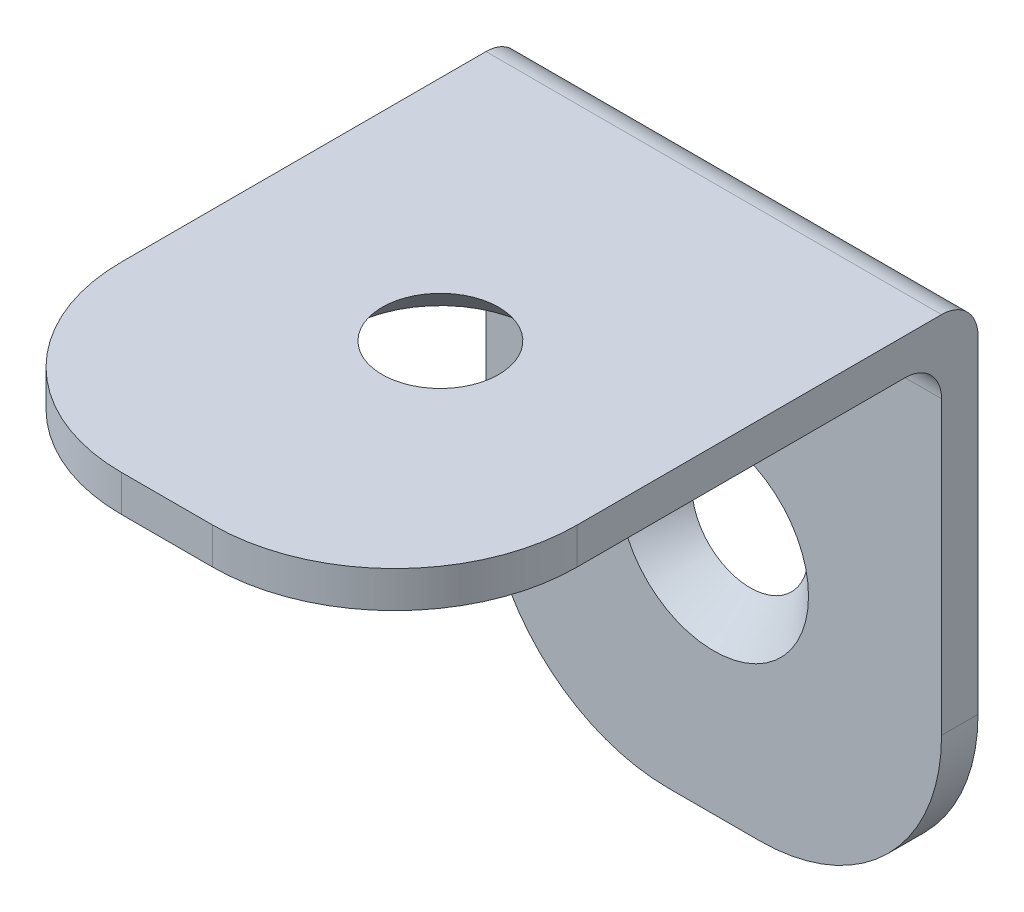
ISO-10303-21;
HEADER;
FILE_DESCRIPTION(('STEP AP214'),'2;1');
FILE_NAME('part.step','',(''),(''),'','','');
FILE_SCHEMA(('AUTOMOTIVE_DESIGN { 1 0 10303 214 1 1 1 1 }'));
ENDSEC;
DATA;
#1=APPLICATION_CONTEXT('core data for automotive mechanical design processes');
#2=APPLICATION_PROTOCOL_DEFINITION('international standard','automotive_design',2000,#1);
#3=PRODUCT_CONTEXT('',#1,'mechanical');
#4=PRODUCT('Part','Part','',(#3));
#5=PRODUCT_RELATED_PRODUCT_CATEGORY('part','',(#4));
#6=PRODUCT_DEFINITION_FORMATION('','',#4);
#7=PRODUCT_DEFINITION_CONTEXT('part definition',#1,'design');
#8=PRODUCT_DEFINITION('design','',#6,#7);
#9=PRODUCT_DEFINITION_SHAPE('','',#8);
#10=(LENGTH_UNIT() NAMED_UNIT(*) SI_UNIT(.MILLI.,.METRE.));
#11=(NAMED_UNIT(*) PLANE_ANGLE_UNIT() SI_UNIT($,.RADIAN.));
#12=(NAMED_UNIT(*) SI_UNIT($,.STERADIAN.) SOLID_ANGLE_UNIT());
#13=UNCERTAINTY_MEASURE_WITH_UNIT(LENGTH_MEASURE(1.E-05),#10,'distance_accuracy_value','');
#14=(GEOMETRIC_REPRESENTATION_CONTEXT(3) GLOBAL_UNCERTAINTY_ASSIGNED_CONTEXT((#13)) GLOBAL_UNIT_ASSIGNED_CONTEXT((#10,
#11,#12)) REPRESENTATION_CONTEXT('',''));
#15=CARTESIAN_POINT('',(0.,0.,0.));
#16=DIRECTION('',(0.,0.,1.));
#17=DIRECTION('',(1.,0.,0.));
#18=AXIS2_PLACEMENT_3D('',#15,#16,#17);
#19=CARTESIAN_POINT('',(-2.50000000000065,2.00000000000003,5.));
#20=DIRECTION('',(0.,-1.,0.));
#21=DIRECTION('',(0.,0.,-1.00000000000001));
#22=AXIS2_PLACEMENT_3D('',#19,#20,#21);
#23=PLANE('',#22);
#24=CARTESIAN_POINT('',(0.,1.99999999999994,0.));
#25=DIRECTION('',(0.,-1.,0.));
#26=DIRECTION('',(0.,0.,-1.00000000000001));
#27=AXIS2_PLACEMENT_3D('',#24,#25,#26);
#28=CIRCLE('',#27,3.2);
#29=CARTESIAN_POINT('',(0.,1.99999999999994,-3.20000000000004));
#30=VERTEX_POINT('',#29);
#31=EDGE_CURVE('E373',#30,#30,#28,.T.);
#32=ORIENTED_EDGE('',*,*,#31,.T.);
#33=EDGE_LOOP('',(#32));
#34=FACE_BOUND('',#33,.T.);
#35=DIRECTION('',(0.,0.,-1.00000000000001));
#36=VECTOR('',#35,1.);
#37=CARTESIAN_POINT('',(12.4999999999992,1.99999999999998,5.00000000000125));
#38=LINE('',#37,#36);
#39=CARTESIAN_POINT('',(12.4999999999992,1.99999999999998,5.00000000000125));
#40=VERTEX_POINT('',#39);
#41=CARTESIAN_POINT('',(12.4999999999997,1.9999999999998,-14.9999999999996));
#42=VERTEX_POINT('',#41);
#43=EDGE_CURVE('E170',#40,#42,#38,.T.);
#44=ORIENTED_EDGE('',*,*,#43,.T.);
#45=DIRECTION('',(1.00000000000001,0.,0.));
#46=VECTOR('',#45,1.);
#47=CARTESIAN_POINT('',(-2.5000000000002,1.99999999999978,-15.000000000001));
#48=LINE('',#47,#46);
#49=CARTESIAN_POINT('',(-12.5000000000003,1.9999999999998,-14.9999999999992));
#50=VERTEX_POINT('',#49);
#51=EDGE_CURVE('E42',#42,#50,#48,.F.);
#52=ORIENTED_EDGE('',*,*,#51,.T.);
#53=DIRECTION('',(0.,0.,1.00000000000001));
#54=VECTOR('',#53,1.);
#55=CARTESIAN_POINT('',(-12.5000000000007,1.99999999999998,5.00000000000164));
#56=LINE('',#55,#54);
#57=CARTESIAN_POINT('',(-12.5000000000007,1.99999999999998,5.00000000000164));
#58=VERTEX_POINT('',#57);
#59=EDGE_CURVE('E172',#50,#58,#56,.T.);
#60=ORIENTED_EDGE('',*,*,#59,.T.);
#61=CARTESIAN_POINT('',(-2.50000000000065,2.00000000000003,5.));
#62=DIRECTION('',(0.,1.,0.));
#63=DIRECTION('',(0.,0.,-1.00000000000001));
#64=AXIS2_PLACEMENT_3D('',#61,#62,#63);
#65=CIRCLE('',#64,10.);
#66=CARTESIAN_POINT('',(-2.50000000000059,2.00000000000004,15.));
#67=VERTEX_POINT('',#66);
#68=EDGE_CURVE('E175',#58,#67,#65,.T.);
#69=ORIENTED_EDGE('',*,*,#68,.T.);
#70=DIRECTION('',(1.00000000000001,0.,0.));
#71=VECTOR('',#70,1.);
#72=CARTESIAN_POINT('',(-2.50000000000059,2.00000000000004,15.));
#73=LINE('',#72,#71);
#74=CARTESIAN_POINT('',(2.49999999999928,2.00000000000006,15.));
#75=VERTEX_POINT('',#74);
#76=EDGE_CURVE('E177',#67,#75,#73,.T.);
#77=ORIENTED_EDGE('',*,*,#76,.T.);
#78=CARTESIAN_POINT('',(2.49999999999935,2.00000000000005,5.));
#79=DIRECTION('',(0.,1.,0.));
#80=DIRECTION('',(0.,0.,1.00000000000001));
#81=AXIS2_PLACEMENT_3D('',#78,#79,#80);
#82=CIRCLE('',#81,10.);
#83=EDGE_CURVE('E179',#75,#40,#82,.T.);
#84=ORIENTED_EDGE('',*,*,#83,.T.);
#85=EDGE_LOOP('',(#44,#52,#60,#69,#77,#84));
#86=FACE_BOUND('',#85,.T.);
#87=ADVANCED_FACE('F34',(#34,#86),#23,.F.);
#88=CARTESIAN_POINT('',(2.49999999999981,-18.,-17.0000000000009));
#89=DIRECTION('',(0.,0.,1.00000000000001));
#90=DIRECTION('',(1.00000000000001,0.,0.));
#91=AXIS2_PLACEMENT_3D('',#88,#89,#90);
#92=PLANE('',#91);
#93=CARTESIAN_POINT('',(-1.94289029309402E-13,-15.0342478014988,-17.0000000000009));
#94=DIRECTION('',(0.,0.,1.00000000000001));
#95=DIRECTION('',(1.00000000000001,0.,0.));
#96=AXIS2_PLACEMENT_3D('',#93,#94,#95);
#97=CIRCLE('',#96,3.19999999999999);
#98=CARTESIAN_POINT('',(3.19999999999985,-15.0342478014988,-17.0000000000009));
#99=VERTEX_POINT('',#98);
#100=EDGE_CURVE('E156',#99,#99,#97,.T.);
#101=ORIENTED_EDGE('',*,*,#100,.T.);
#102=EDGE_LOOP('',(#101));
#103=FACE_BOUND('',#102,.T.);
#104=DIRECTION('',(0.,1.,0.));
#105=VECTOR('',#104,1.);
#106=CARTESIAN_POINT('',(-12.5000000000002,-18.0000000000001,-16.9999999999992));
#107=LINE('',#106,#105);
#108=CARTESIAN_POINT('',(-12.5000000000002,-18.0000000000001,-16.9999999999992));
#109=VERTEX_POINT('',#108);
#110=CARTESIAN_POINT('',(-12.5000000000002,-1.67400815431762E-13,-16.9999999999992));
#111=VERTEX_POINT('',#110);
#112=EDGE_CURVE('E130',#109,#111,#107,.T.);
#113=ORIENTED_EDGE('',*,*,#112,.T.);
#114=DIRECTION('',(1.00000000000001,0.,0.));
#115=VECTOR('',#114,1.);
#116=CARTESIAN_POINT('',(2.49999999999981,-1.10154940724527E-13,-17.0000000000009));
#117=LINE('',#116,#115);
#118=CARTESIAN_POINT('',(12.4999999999996,-1.10154940724527E-13,-16.9999999999996));
#119=VERTEX_POINT('',#118);
#120=EDGE_CURVE('E129',#111,#119,#117,.T.);
#121=ORIENTED_EDGE('',*,*,#120,.T.);
#122=DIRECTION('',(0.,-1.,0.));
#123=VECTOR('',#122,1.);
#124=CARTESIAN_POINT('',(12.4999999999996,-18.,-16.9999999999996));
#125=LINE('',#124,#123);
#126=CARTESIAN_POINT('',(12.4999999999996,-18.,-16.9999999999996));
#127=VERTEX_POINT('',#126);
#128=EDGE_CURVE('E121',#119,#127,#125,.T.);
#129=ORIENTED_EDGE('',*,*,#128,.T.);
#130=CARTESIAN_POINT('',(2.49999999999981,-18.,-17.0000000000009));
#131=DIRECTION('',(0.,0.,-1.00000000000001));
#132=DIRECTION('',(1.00000000000001,0.,0.));
#133=AXIS2_PLACEMENT_3D('',#130,#131,#132);
#134=CIRCLE('',#133,10.);
#135=CARTESIAN_POINT('',(2.49999999999981,-28.0000000000002,-17.000000000001));
#136=VERTEX_POINT('',#135);
#137=EDGE_CURVE('E126',#127,#136,#134,.T.);
#138=ORIENTED_EDGE('',*,*,#137,.T.);
#139=DIRECTION('',(-1.00000000000001,0.,0.));
#140=VECTOR('',#139,1.);
#141=CARTESIAN_POINT('',(2.49999999999981,-28.0000000000002,-17.000000000001));
#142=LINE('',#141,#140);
#143=CARTESIAN_POINT('',(-2.5000000000002,-28.0000000000002,-17.0000000000009));
#144=VERTEX_POINT('',#143);
#145=EDGE_CURVE('E145',#136,#144,#142,.T.);
#146=ORIENTED_EDGE('',*,*,#145,.T.);
#147=CARTESIAN_POINT('',(-2.5000000000002,-18.,-17.0000000000009));
#148=DIRECTION('',(0.,0.,-1.00000000000001));
#149=DIRECTION('',(-1.00000000000001,0.,0.));
#150=AXIS2_PLACEMENT_3D('',#147,#148,#149);
#151=CIRCLE('',#150,10.);
#152=EDGE_CURVE('E147',#144,#109,#151,.T.);
#153=ORIENTED_EDGE('',*,*,#152,.T.);
#154=EDGE_LOOP('',(#113,#121,#129,#138,#146,#153));
#155=FACE_BOUND('',#154,.T.);
#156=ADVANCED_FACE('F124',(#103,#155),#92,.F.);
#157=CARTESIAN_POINT('',(12.4999999999992,1.99999999999998,5.00000000000125));
#158=DIRECTION('',(-1.00000000000001,0.,0.));
#159=DIRECTION('',(0.,0.,1.00000000000001));
#160=AXIS2_PLACEMENT_3D('',#157,#158,#159);
#161=PLANE('',#160);
#162=ORIENTED_EDGE('',*,*,#128,.F.);
#163=CARTESIAN_POINT('',(12.4999999999997,-1.37910516340156E-13,-14.9999999999996));
#164=DIRECTION('',(-1.00000000000001,0.,0.));
#165=DIRECTION('',(0.,0.,1.00000000000001));
#166=AXIS2_PLACEMENT_3D('',#163,#164,#165);
#167=CIRCLE('',#166,2.);
#168=EDGE_CURVE('E56',#119,#42,#167,.F.);
#169=ORIENTED_EDGE('',*,*,#168,.T.);
#170=ORIENTED_EDGE('',*,*,#43,.F.);
#171=DIRECTION('',(0.,-1.,0.));
#172=VECTOR('',#171,1.);
#173=CARTESIAN_POINT('',(12.4999999999992,1.99999999999998,5.00000000000125));
#174=LINE('',#173,#172);
#175=CARTESIAN_POINT('',(12.4999999999992,0.,5.00000000000125));
#176=VERTEX_POINT('',#175);
#177=EDGE_CURVE('E181',#40,#176,#174,.T.);
#178=ORIENTED_EDGE('',*,*,#177,.T.);
#179=DIRECTION('',(0.,0.,-1.00000000000001));
#180=VECTOR('',#179,1.);
#181=CARTESIAN_POINT('',(12.4999999999992,0.,5.00000000000125));
#182=LINE('',#181,#180);
#183=CARTESIAN_POINT('',(12.4999999999995,-1.37910516340156E-13,-12.9999999999996));
#184=VERTEX_POINT('',#183);
#185=EDGE_CURVE('E139',#176,#184,#182,.T.);
#186=ORIENTED_EDGE('',*,*,#185,.T.);
#187=CARTESIAN_POINT('',(12.4999999999995,-2.00000000000013,-12.9999999999996));
#188=DIRECTION('',(-1.00000000000001,0.,0.));
#189=DIRECTION('',(0.,0.,1.00000000000001));
#190=AXIS2_PLACEMENT_3D('',#187,#188,#189);
#191=CIRCLE('',#190,2.);
#192=CARTESIAN_POINT('',(12.4999999999997,-2.00000000000016,-14.9999999999996));
#193=VERTEX_POINT('',#192);
#194=EDGE_CURVE('E209',#184,#193,#191,.T.);
#195=ORIENTED_EDGE('',*,*,#194,.T.);
#196=DIRECTION('',(0.,-1.,0.));
#197=VECTOR('',#196,1.);
#198=CARTESIAN_POINT('',(12.4999999999997,-18.,-14.9999999999996));
#199=LINE('',#198,#197);
#200=CARTESIAN_POINT('',(12.4999999999997,-18.,-14.9999999999996));
#201=VERTEX_POINT('',#200);
#202=EDGE_CURVE('E136',#193,#201,#199,.T.);
#203=ORIENTED_EDGE('',*,*,#202,.T.);
#204=DIRECTION('',(0.,0.,1.00000000000001));
#205=VECTOR('',#204,1.);
#206=CARTESIAN_POINT('',(12.4999999999996,-18.,-16.9999999999996));
#207=LINE('',#206,#205);
#208=EDGE_CURVE('E133',#127,#201,#207,.T.);
#209=ORIENTED_EDGE('',*,*,#208,.F.);
#210=EDGE_LOOP('',(#162,#169,#170,#178,#186,#195,#203,#209));
#211=FACE_BOUND('',#210,.T.);
#212=ADVANCED_FACE('F134',(#211),#161,.F.);
#213=CARTESIAN_POINT('',(-12.5000000000007,1.99999999999998,5.00000000000164));
#214=DIRECTION('',(1.00000000000001,0.,0.));
#215=DIRECTION('',(0.,0.,-1.00000000000001));
#216=AXIS2_PLACEMENT_3D('',#213,#214,#215);
#217=PLANE('',#216);
#218=ORIENTED_EDGE('',*,*,#59,.F.);
#219=CARTESIAN_POINT('',(-12.5000000000003,-2.09901540593194E-13,-14.9999999999992));
#220=DIRECTION('',(1.00000000000001,0.,0.));
#221=DIRECTION('',(0.,0.,-1.00000000000001));
#222=AXIS2_PLACEMENT_3D('',#219,#220,#221);
#223=CIRCLE('',#222,2.);
#224=EDGE_CURVE('E11',#50,#111,#223,.F.);
#225=ORIENTED_EDGE('',*,*,#224,.T.);
#226=ORIENTED_EDGE('',*,*,#112,.F.);
#227=DIRECTION('',(0.,0.,1.00000000000001));
#228=VECTOR('',#227,1.);
#229=CARTESIAN_POINT('',(-12.5000000000002,-18.0000000000001,-16.9999999999992));
#230=LINE('',#229,#228);
#231=CARTESIAN_POINT('',(-12.5000000000003,-18.,-14.9999999999992));
#232=VERTEX_POINT('',#231);
#233=EDGE_CURVE('E152',#109,#232,#230,.T.);
#234=ORIENTED_EDGE('',*,*,#233,.T.);
#235=DIRECTION('',(0.,1.,0.));
#236=VECTOR('',#235,1.);
#237=CARTESIAN_POINT('',(-12.5000000000003,-18.,-14.9999999999992));
#238=LINE('',#237,#236);
#239=CARTESIAN_POINT('',(-12.5000000000003,-2.00000000000017,-14.9999999999992));
#240=VERTEX_POINT('',#239);
#241=EDGE_CURVE('E153',#232,#240,#238,.T.);
#242=ORIENTED_EDGE('',*,*,#241,.T.);
#243=CARTESIAN_POINT('',(-12.5000000000004,-2.00000000000014,-12.9999999999992));
#244=DIRECTION('',(1.00000000000001,0.,0.));
#245=DIRECTION('',(0.,0.,-1.00000000000001));
#246=AXIS2_PLACEMENT_3D('',#243,#244,#245);
#247=CIRCLE('',#246,2.);
#248=CARTESIAN_POINT('',(-12.5000000000004,-2.09901540593194E-13,-12.9999999999992));
#249=VERTEX_POINT('',#248);
#250=EDGE_CURVE('E207',#240,#249,#247,.T.);
#251=ORIENTED_EDGE('',*,*,#250,.T.);
#252=DIRECTION('',(0.,0.,1.00000000000001));
#253=VECTOR('',#252,1.);
#254=CARTESIAN_POINT('',(-12.5000000000007,0.,5.00000000000164));
#255=LINE('',#254,#253);
#256=CARTESIAN_POINT('',(-12.5000000000007,0.,5.00000000000164));
#257=VERTEX_POINT('',#256);
#258=EDGE_CURVE('E184',#249,#257,#255,.T.);
#259=ORIENTED_EDGE('',*,*,#258,.T.);
#260=DIRECTION('',(0.,-1.,0.));
#261=VECTOR('',#260,1.);
#262=CARTESIAN_POINT('',(-12.5000000000007,1.99999999999998,5.00000000000164));
#263=LINE('',#262,#261);
#264=EDGE_CURVE('E199',#58,#257,#263,.T.);
#265=ORIENTED_EDGE('',*,*,#264,.F.);
#266=EDGE_LOOP('',(#218,#225,#226,#234,#242,#251,#259,#265));
#267=FACE_BOUND('',#266,.T.);
#268=ADVANCED_FACE('F224',(#267),#217,.F.);
#269=CARTESIAN_POINT('',(-2.50000000000065,2.00000000000003,5.));
#270=DIRECTION('',(0.,-1.,0.));
#271=DIRECTION('',(0.,0.,-1.00000000000001));
#272=AXIS2_PLACEMENT_3D('',#269,#270,#271);
#273=CYLINDRICAL_SURFACE('',#272,10.);
#274=CARTESIAN_POINT('',(-2.50000000000065,1.04950770296597E-13,5.));
#275=DIRECTION('',(0.,1.,0.));
#276=DIRECTION('',(0.,0.,-1.00000000000001));
#277=AXIS2_PLACEMENT_3D('',#274,#275,#276);
#278=CIRCLE('',#277,10.);
#279=CARTESIAN_POINT('',(-2.50000000000059,0.,15.));
#280=VERTEX_POINT('',#279);
#281=EDGE_CURVE('E186',#257,#280,#278,.T.);
#282=ORIENTED_EDGE('',*,*,#281,.T.);
#283=DIRECTION('',(0.,-1.,0.));
#284=VECTOR('',#283,1.);
#285=CARTESIAN_POINT('',(-2.50000000000059,2.00000000000004,15.));
#286=LINE('',#285,#284);
#287=EDGE_CURVE('E196',#67,#280,#286,.T.);
#288=ORIENTED_EDGE('',*,*,#287,.F.);
#289=ORIENTED_EDGE('',*,*,#68,.F.);
#290=ORIENTED_EDGE('',*,*,#264,.T.);
#291=EDGE_LOOP('',(#282,#288,#289,#290));
#292=FACE_BOUND('',#291,.T.);
#293=ADVANCED_FACE('F233',(#292),#273,.T.);
#294=CARTESIAN_POINT('',(-2.50000000000059,2.00000000000004,15.));
#295=DIRECTION('',(0.,0.,-1.00000000000001));
#296=DIRECTION('',(-1.00000000000001,0.,0.));
#297=AXIS2_PLACEMENT_3D('',#294,#295,#296);
#298=PLANE('',#297);
#299=DIRECTION('',(1.00000000000001,0.,0.));
#300=VECTOR('',#299,1.);
#301=CARTESIAN_POINT('',(-2.50000000000059,0.,15.));
#302=LINE('',#301,#300);
#303=CARTESIAN_POINT('',(2.49999999999928,0.,15.));
#304=VERTEX_POINT('',#303);
#305=EDGE_CURVE('E188',#280,#304,#302,.T.);
#306=ORIENTED_EDGE('',*,*,#305,.T.);
#307=DIRECTION('',(0.,-1.,0.));
#308=VECTOR('',#307,1.);
#309=CARTESIAN_POINT('',(2.49999999999928,2.00000000000006,15.));
#310=LINE('',#309,#308);
#311=EDGE_CURVE('E193',#75,#304,#310,.T.);
#312=ORIENTED_EDGE('',*,*,#311,.F.);
#313=ORIENTED_EDGE('',*,*,#76,.F.);
#314=ORIENTED_EDGE('',*,*,#287,.T.);
#315=EDGE_LOOP('',(#306,#312,#313,#314));
#316=FACE_BOUND('',#315,.T.);
#317=ADVANCED_FACE('F237',(#316),#298,.F.);
#318=CARTESIAN_POINT('',(2.49999999999935,2.00000000000005,5.));
#319=DIRECTION('',(0.,-1.,0.));
#320=DIRECTION('',(0.,0.,-1.00000000000001));
#321=AXIS2_PLACEMENT_3D('',#318,#319,#320);
#322=CYLINDRICAL_SURFACE('',#321,10.);
#323=CARTESIAN_POINT('',(2.49999999999935,0.,5.));
#324=DIRECTION('',(0.,1.,0.));
#325=DIRECTION('',(0.,0.,1.00000000000001));
#326=AXIS2_PLACEMENT_3D('',#323,#324,#325);
#327=CIRCLE('',#326,10.);
#328=EDGE_CURVE('E173',#304,#176,#327,.T.);
#329=ORIENTED_EDGE('',*,*,#328,.T.);
#330=ORIENTED_EDGE('',*,*,#177,.F.);
#331=ORIENTED_EDGE('',*,*,#83,.F.);
#332=ORIENTED_EDGE('',*,*,#311,.T.);
#333=EDGE_LOOP('',(#329,#330,#331,#332));
#334=FACE_BOUND('',#333,.T.);
#335=ADVANCED_FACE('F267',(#334),#322,.T.);
#336=CARTESIAN_POINT('',(-2.50000000000065,1.04950770296597E-13,5.));
#337=DIRECTION('',(0.,-1.,0.));
#338=DIRECTION('',(0.,0.,-1.00000000000001));
#339=AXIS2_PLACEMENT_3D('',#336,#337,#338);
#340=PLANE('',#339);
#341=CARTESIAN_POINT('',(0.,0.,0.));
#342=DIRECTION('',(0.,-1.,0.));
#343=DIRECTION('',(0.,0.,-1.00000000000001));
#344=AXIS2_PLACEMENT_3D('',#341,#342,#343);
#345=CIRCLE('',#344,5.2);
#346=CARTESIAN_POINT('',(0.,0.,-5.20000000000008));
#347=VERTEX_POINT('',#346);
#348=EDGE_CURVE('E371',#347,#347,#345,.T.);
#349=ORIENTED_EDGE('',*,*,#348,.F.);
#350=EDGE_LOOP('',(#349));
#351=FACE_BOUND('',#350,.T.);
#352=ORIENTED_EDGE('',*,*,#258,.F.);
#353=DIRECTION('',(-1.00000000000001,0.,0.));
#354=VECTOR('',#353,1.);
#355=CARTESIAN_POINT('',(12.4999999999995,-1.37910516340156E-13,-12.9999999999996));
#356=LINE('',#355,#354);
#357=EDGE_CURVE('E205',#249,#184,#356,.F.);
#358=ORIENTED_EDGE('',*,*,#357,.T.);
#359=ORIENTED_EDGE('',*,*,#185,.F.);
#360=ORIENTED_EDGE('',*,*,#328,.F.);
#361=ORIENTED_EDGE('',*,*,#305,.F.);
#362=ORIENTED_EDGE('',*,*,#281,.F.);
#363=EDGE_LOOP('',(#352,#358,#359,#360,#361,#362));
#364=FACE_BOUND('',#363,.T.);
#365=ADVANCED_FACE('F228',(#351,#364),#340,.T.);
#366=CARTESIAN_POINT('',(2.49999999999981,-18.,-17.0000000000009));
#367=DIRECTION('',(0.,0.,1.00000000000001));
#368=DIRECTION('',(1.00000000000001,0.,0.));
#369=AXIS2_PLACEMENT_3D('',#366,#367,#368);
#370=CYLINDRICAL_SURFACE('',#369,10.);
#371=CARTESIAN_POINT('',(2.49999999999981,-18.0000000000001,-15.000000000001));
#372=DIRECTION('',(0.,0.,-1.00000000000001));
#373=DIRECTION('',(1.00000000000001,0.,0.));
#374=AXIS2_PLACEMENT_3D('',#371,#372,#373);
#375=CIRCLE('',#374,10.);
#376=CARTESIAN_POINT('',(2.49999999999981,-28.0000000000002,-15.000000000001));
#377=VERTEX_POINT('',#376);
#378=EDGE_CURVE('E158',#201,#377,#375,.T.);
#379=ORIENTED_EDGE('',*,*,#378,.T.);
#380=DIRECTION('',(0.,0.,1.00000000000001));
#381=VECTOR('',#380,1.);
#382=CARTESIAN_POINT('',(2.49999999999981,-28.0000000000002,-17.000000000001));
#383=LINE('',#382,#381);
#384=EDGE_CURVE('E140',#136,#377,#383,.T.);
#385=ORIENTED_EDGE('',*,*,#384,.F.);
#386=ORIENTED_EDGE('',*,*,#137,.F.);
#387=ORIENTED_EDGE('',*,*,#208,.T.);
#388=EDGE_LOOP('',(#379,#385,#386,#387));
#389=FACE_BOUND('',#388,.T.);
#390=ADVANCED_FACE('F142',(#389),#370,.T.);
#391=CARTESIAN_POINT('',(2.49999999999981,-28.0000000000002,-17.000000000001));
#392=DIRECTION('',(0.,1.,0.));
#393=DIRECTION('',(0.,0.,1.00000000000001));
#394=AXIS2_PLACEMENT_3D('',#391,#392,#393);
#395=PLANE('',#394);
#396=DIRECTION('',(-1.00000000000001,0.,0.));
#397=VECTOR('',#396,1.);
#398=CARTESIAN_POINT('',(2.49999999999981,-28.0000000000002,-15.000000000001));
#399=LINE('',#398,#397);
#400=CARTESIAN_POINT('',(-2.5000000000002,-28.0000000000002,-15.000000000001));
#401=VERTEX_POINT('',#400);
#402=EDGE_CURVE('E160',#377,#401,#399,.T.);
#403=ORIENTED_EDGE('',*,*,#402,.T.);
#404=DIRECTION('',(0.,0.,1.00000000000001));
#405=VECTOR('',#404,1.);
#406=CARTESIAN_POINT('',(-2.5000000000002,-28.0000000000002,-17.0000000000009));
#407=LINE('',#406,#405);
#408=EDGE_CURVE('E166',#144,#401,#407,.T.);
#409=ORIENTED_EDGE('',*,*,#408,.F.);
#410=ORIENTED_EDGE('',*,*,#145,.F.);
#411=ORIENTED_EDGE('',*,*,#384,.T.);
#412=EDGE_LOOP('',(#403,#409,#410,#411));
#413=FACE_BOUND('',#412,.T.);
#414=ADVANCED_FACE('F309',(#413),#395,.F.);
#415=CARTESIAN_POINT('',(-2.5000000000002,-18.,-17.0000000000009));
#416=DIRECTION('',(0.,0.,1.00000000000001));
#417=DIRECTION('',(1.00000000000001,0.,0.));
#418=AXIS2_PLACEMENT_3D('',#415,#416,#417);
#419=CYLINDRICAL_SURFACE('',#418,10.);
#420=CARTESIAN_POINT('',(-2.5000000000002,-18.0000000000001,-15.000000000001));
#421=DIRECTION('',(0.,0.,-1.00000000000001));
#422=DIRECTION('',(-1.00000000000001,0.,0.));
#423=AXIS2_PLACEMENT_3D('',#420,#421,#422);
#424=CIRCLE('',#423,10.);
#425=EDGE_CURVE('E162',#401,#232,#424,.T.);
#426=ORIENTED_EDGE('',*,*,#425,.T.);
#427=ORIENTED_EDGE('',*,*,#233,.F.);
#428=ORIENTED_EDGE('',*,*,#152,.F.);
#429=ORIENTED_EDGE('',*,*,#408,.T.);
#430=EDGE_LOOP('',(#426,#427,#428,#429));
#431=FACE_BOUND('',#430,.T.);
#432=ADVANCED_FACE('F315',(#431),#419,.T.);
#433=CARTESIAN_POINT('',(2.49999999999981,-18.0000000000001,-15.000000000001));
#434=DIRECTION('',(0.,0.,1.00000000000001));
#435=DIRECTION('',(1.00000000000001,0.,0.));
#436=AXIS2_PLACEMENT_3D('',#433,#434,#435);
#437=PLANE('',#436);
#438=CARTESIAN_POINT('',(-1.94289029309402E-13,-15.0342478014988,-15.0000000000009));
#439=DIRECTION('',(0.,0.,1.00000000000001));
#440=DIRECTION('',(1.00000000000001,0.,0.));
#441=AXIS2_PLACEMENT_3D('',#438,#439,#440);
#442=CIRCLE('',#441,5.2);
#443=CARTESIAN_POINT('',(5.19999999999988,-15.0342478014988,-15.0000000000009));
#444=VERTEX_POINT('',#443);
#445=EDGE_CURVE('E374',#444,#444,#442,.T.);
#446=ORIENTED_EDGE('',*,*,#445,.F.);
#447=EDGE_LOOP('',(#446));
#448=FACE_BOUND('',#447,.T.);
#449=ORIENTED_EDGE('',*,*,#202,.F.);
#450=DIRECTION('',(-1.00000000000001,0.,0.));
#451=VECTOR('',#450,1.);
#452=CARTESIAN_POINT('',(-12.5000000000003,-2.00000000000017,-14.9999999999992));
#453=LINE('',#452,#451);
#454=EDGE_CURVE('E202',#193,#240,#453,.T.);
#455=ORIENTED_EDGE('',*,*,#454,.T.);
#456=ORIENTED_EDGE('',*,*,#241,.F.);
#457=ORIENTED_EDGE('',*,*,#425,.F.);
#458=ORIENTED_EDGE('',*,*,#402,.F.);
#459=ORIENTED_EDGE('',*,*,#378,.F.);
#460=EDGE_LOOP('',(#449,#455,#456,#457,#458,#459));
#461=FACE_BOUND('',#460,.T.);
#462=ADVANCED_FACE('F218',(#448,#461),#437,.T.);
#463=CARTESIAN_POINT('',(2.49999999999981,-2.00000000000009,-13.000000000001));
#464=DIRECTION('',(1.00000000000001,0.,0.));
#465=DIRECTION('',(0.,0.,-1.00000000000001));
#466=AXIS2_PLACEMENT_3D('',#463,#464,#465);
#467=CYLINDRICAL_SURFACE('',#466,2.);
#468=ORIENTED_EDGE('',*,*,#194,.F.);
#469=ORIENTED_EDGE('',*,*,#357,.F.);
#470=ORIENTED_EDGE('',*,*,#250,.F.);
#471=ORIENTED_EDGE('',*,*,#454,.F.);
#472=EDGE_LOOP('',(#468,#469,#470,#471));
#473=FACE_BOUND('',#472,.T.);
#474=ADVANCED_FACE('F221',(#473),#467,.F.);
#475=CARTESIAN_POINT('',(2.49999999999981,-2.36789754470834E-13,-15.000000000001));
#476=DIRECTION('',(1.00000000000001,0.,0.));
#477=DIRECTION('',(0.,0.,-1.00000000000001));
#478=AXIS2_PLACEMENT_3D('',#475,#476,#477);
#479=CYLINDRICAL_SURFACE('',#478,2.);
#480=ORIENTED_EDGE('',*,*,#224,.F.);
#481=ORIENTED_EDGE('',*,*,#51,.F.);
#482=ORIENTED_EDGE('',*,*,#168,.F.);
#483=ORIENTED_EDGE('',*,*,#120,.F.);
#484=EDGE_LOOP('',(#480,#481,#482,#483));
#485=FACE_BOUND('',#484,.T.);
#486=ADVANCED_FACE('F36',(#485),#479,.T.);
#487=CARTESIAN_POINT('',(-1.94289029309402E-13,-15.0342478014988,-15.0000000000009));
#488=DIRECTION('',(0.,0.,1.00000000000001));
#489=DIRECTION('',(1.00000000000001,0.,0.));
#490=AXIS2_PLACEMENT_3D('',#487,#488,#489);
#491=CONICAL_SURFACE('',#490,5.2,0.785398163397449);
#492=ORIENTED_EDGE('',*,*,#445,.T.);
#493=EDGE_LOOP('',(#492));
#494=FACE_BOUND('',#493,.T.);
#495=ORIENTED_EDGE('',*,*,#100,.F.);
#496=EDGE_LOOP('',(#495));
#497=FACE_BOUND('',#496,.T.);
#498=ADVANCED_FACE('F245',(#494,#497),#491,.F.);
#499=CARTESIAN_POINT('',(0.,0.,0.));
#500=DIRECTION('',(0.,-1.,0.));
#501=DIRECTION('',(0.,0.,-1.00000000000001));
#502=AXIS2_PLACEMENT_3D('',#499,#500,#501);
#503=CONICAL_SURFACE('',#502,5.2,0.785398163397449);
#504=ORIENTED_EDGE('',*,*,#348,.T.);
#505=EDGE_LOOP('',(#504));
#506=FACE_BOUND('',#505,.T.);
#507=ORIENTED_EDGE('',*,*,#31,.F.);
#508=EDGE_LOOP('',(#507));
#509=FACE_BOUND('',#508,.T.);
#510=ADVANCED_FACE('F250',(#506,#509),#503,.F.);
#511=CLOSED_SHELL('',(#87,#156,#212,#268,#293,#317,#335,#365,#390,#414,#432,#462,#474,#486,#498,#510));
#512=MANIFOLD_SOLID_BREP('B2',#511);
#513=ADVANCED_BREP_SHAPE_REPRESENTATION('',(#18,#512),#14);
#514=SHAPE_DEFINITION_REPRESENTATION(#9,#513);
ENDSEC;
END-ISO-10303-21;
